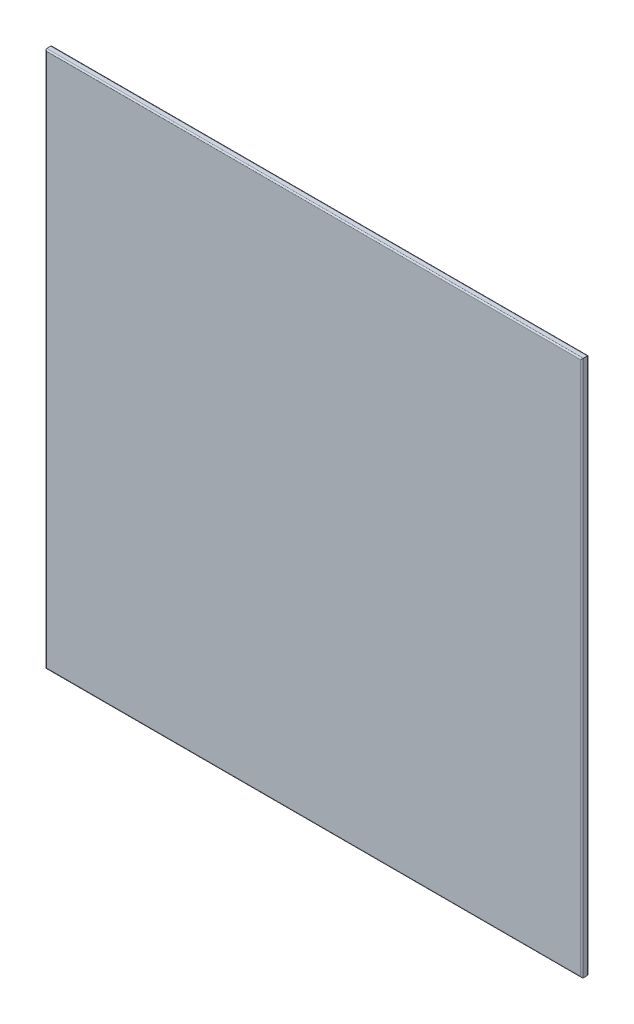
ISO-10303-21;
HEADER;
FILE_DESCRIPTION(('STEP AP214'),'2;1');
FILE_NAME('part.step','',(''),(''),'','','');
FILE_SCHEMA(('AUTOMOTIVE_DESIGN { 1 0 10303 214 1 1 1 1 }'));
ENDSEC;
DATA;
#1=APPLICATION_CONTEXT('core data for automotive mechanical design processes');
#2=APPLICATION_PROTOCOL_DEFINITION('international standard','automotive_design',2000,#1);
#3=PRODUCT_CONTEXT('',#1,'mechanical');
#4=PRODUCT('Part','Part','',(#3));
#5=PRODUCT_RELATED_PRODUCT_CATEGORY('part','',(#4));
#6=PRODUCT_DEFINITION_FORMATION('','',#4);
#7=PRODUCT_DEFINITION_CONTEXT('part definition',#1,'design');
#8=PRODUCT_DEFINITION('design','',#6,#7);
#9=PRODUCT_DEFINITION_SHAPE('','',#8);
#10=(LENGTH_UNIT() NAMED_UNIT(*) SI_UNIT(.MILLI.,.METRE.));
#11=(NAMED_UNIT(*) PLANE_ANGLE_UNIT() SI_UNIT($,.RADIAN.));
#12=(NAMED_UNIT(*) SI_UNIT($,.STERADIAN.) SOLID_ANGLE_UNIT());
#13=UNCERTAINTY_MEASURE_WITH_UNIT(LENGTH_MEASURE(1.E-05),#10,'distance_accuracy_value','');
#14=(GEOMETRIC_REPRESENTATION_CONTEXT(3) GLOBAL_UNCERTAINTY_ASSIGNED_CONTEXT((#13)) GLOBAL_UNIT_ASSIGNED_CONTEXT((#10,
#11,#12)) REPRESENTATION_CONTEXT('',''));
#15=CARTESIAN_POINT('',(0.,0.,0.));
#16=DIRECTION('',(0.,0.,1.));
#17=DIRECTION('',(1.,0.,0.));
#18=AXIS2_PLACEMENT_3D('',#15,#16,#17);
#19=CARTESIAN_POINT('',(-609.999999999993,-610.000000000001,15.));
#20=DIRECTION('',(1.,0.,0.));
#21=DIRECTION('',(0.,0.,-1.));
#22=AXIS2_PLACEMENT_3D('',#19,#20,#21);
#23=PLANE('',#22);
#24=DIRECTION('',(0.,0.,-1.));
#25=VECTOR('',#24,1.);
#26=CARTESIAN_POINT('',(-609.999999999993,609.999999999999,15.));
#27=LINE('',#26,#25);
#28=CARTESIAN_POINT('',(-609.999999999993,609.999999999999,12.));
#29=VERTEX_POINT('',#28);
#30=CARTESIAN_POINT('',(-609.999999999993,609.999999999999,3.));
#31=VERTEX_POINT('',#30);
#32=EDGE_CURVE('E144',#29,#31,#27,.T.);
#33=ORIENTED_EDGE('',*,*,#32,.T.);
#34=DIRECTION('',(0.,-1.,0.));
#35=VECTOR('',#34,1.);
#36=CARTESIAN_POINT('',(-609.999999999993,-610.000000000001,3.));
#37=LINE('',#36,#35);
#38=CARTESIAN_POINT('',(-609.999999999993,-610.000000000001,3.));
#39=VERTEX_POINT('',#38);
#40=EDGE_CURVE('E153',#31,#39,#37,.T.);
#41=ORIENTED_EDGE('',*,*,#40,.T.);
#42=DIRECTION('',(0.,0.,-1.));
#43=VECTOR('',#42,1.);
#44=CARTESIAN_POINT('',(-609.999999999993,-610.000000000001,15.));
#45=LINE('',#44,#43);
#46=CARTESIAN_POINT('',(-609.999999999993,-610.000000000001,12.));
#47=VERTEX_POINT('',#46);
#48=EDGE_CURVE('E122',#47,#39,#45,.T.);
#49=ORIENTED_EDGE('',*,*,#48,.F.);
#50=DIRECTION('',(0.,-1.,0.));
#51=VECTOR('',#50,1.);
#52=CARTESIAN_POINT('',(-609.999999999993,-610.000000000001,12.));
#53=LINE('',#52,#51);
#54=EDGE_CURVE('E155',#47,#29,#53,.F.);
#55=ORIENTED_EDGE('',*,*,#54,.T.);
#56=EDGE_LOOP('',(#33,#41,#49,#55));
#57=FACE_BOUND('',#56,.T.);
#58=ADVANCED_FACE('F35',(#57),#23,.F.);
#59=CARTESIAN_POINT('',(-609.999999999993,-610.000000000001,15.));
#60=DIRECTION('',(0.,1.,0.));
#61=DIRECTION('',(0.,0.,1.));
#62=AXIS2_PLACEMENT_3D('',#59,#60,#61);
#63=PLANE('',#62);
#64=ORIENTED_EDGE('',*,*,#48,.T.);
#65=DIRECTION('',(1.,0.,0.));
#66=VECTOR('',#65,1.);
#67=CARTESIAN_POINT('',(609.999999999996,-610.000000000001,3.));
#68=LINE('',#67,#66);
#69=CARTESIAN_POINT('',(609.999999999996,-610.000000000001,3.));
#70=VERTEX_POINT('',#69);
#71=EDGE_CURVE('E121',#39,#70,#68,.T.);
#72=ORIENTED_EDGE('',*,*,#71,.T.);
#73=DIRECTION('',(0.,0.,-1.));
#74=VECTOR('',#73,1.);
#75=CARTESIAN_POINT('',(609.999999999996,-610.000000000001,15.));
#76=LINE('',#75,#74);
#77=CARTESIAN_POINT('',(609.999999999996,-610.000000000001,12.));
#78=VERTEX_POINT('',#77);
#79=EDGE_CURVE('E104',#78,#70,#76,.T.);
#80=ORIENTED_EDGE('',*,*,#79,.F.);
#81=DIRECTION('',(1.,0.,0.));
#82=VECTOR('',#81,1.);
#83=CARTESIAN_POINT('',(-609.999999999993,-610.000000000001,12.));
#84=LINE('',#83,#82);
#85=EDGE_CURVE('E118',#78,#47,#84,.F.);
#86=ORIENTED_EDGE('',*,*,#85,.T.);
#87=EDGE_LOOP('',(#64,#72,#80,#86));
#88=FACE_BOUND('',#87,.T.);
#89=ADVANCED_FACE('F117',(#88),#63,.F.);
#90=CARTESIAN_POINT('',(609.999999999996,-610.000000000001,15.));
#91=DIRECTION('',(-1.,0.,0.));
#92=DIRECTION('',(0.,0.,1.));
#93=AXIS2_PLACEMENT_3D('',#90,#91,#92);
#94=PLANE('',#93);
#95=ORIENTED_EDGE('',*,*,#79,.T.);
#96=DIRECTION('',(0.,1.,0.));
#97=VECTOR('',#96,1.);
#98=CARTESIAN_POINT('',(609.999999999996,609.999999999999,3.));
#99=LINE('',#98,#97);
#100=CARTESIAN_POINT('',(609.999999999996,609.999999999999,3.));
#101=VERTEX_POINT('',#100);
#102=EDGE_CURVE('E110',#70,#101,#99,.T.);
#103=ORIENTED_EDGE('',*,*,#102,.T.);
#104=DIRECTION('',(0.,0.,-1.));
#105=VECTOR('',#104,1.);
#106=CARTESIAN_POINT('',(609.999999999996,609.999999999999,15.));
#107=LINE('',#106,#105);
#108=CARTESIAN_POINT('',(609.999999999996,609.999999999999,12.));
#109=VERTEX_POINT('',#108);
#110=EDGE_CURVE('E106',#109,#101,#107,.T.);
#111=ORIENTED_EDGE('',*,*,#110,.F.);
#112=DIRECTION('',(0.,1.,0.));
#113=VECTOR('',#112,1.);
#114=CARTESIAN_POINT('',(609.999999999996,-610.000000000001,12.));
#115=LINE('',#114,#113);
#116=EDGE_CURVE('E101',#109,#78,#115,.F.);
#117=ORIENTED_EDGE('',*,*,#116,.T.);
#118=EDGE_LOOP('',(#95,#103,#111,#117));
#119=FACE_BOUND('',#118,.T.);
#120=ADVANCED_FACE('F103',(#119),#94,.F.);
#121=CARTESIAN_POINT('',(-609.999999999993,609.999999999999,15.));
#122=DIRECTION('',(0.,-1.,0.));
#123=DIRECTION('',(0.,0.,-1.));
#124=AXIS2_PLACEMENT_3D('',#121,#122,#123);
#125=PLANE('',#124);
#126=ORIENTED_EDGE('',*,*,#110,.T.);
#127=DIRECTION('',(-1.,0.,0.));
#128=VECTOR('',#127,1.);
#129=CARTESIAN_POINT('',(-609.999999999993,609.999999999999,3.));
#130=LINE('',#129,#128);
#131=EDGE_CURVE('E157',#101,#31,#130,.T.);
#132=ORIENTED_EDGE('',*,*,#131,.T.);
#133=ORIENTED_EDGE('',*,*,#32,.F.);
#134=DIRECTION('',(-1.,0.,0.));
#135=VECTOR('',#134,1.);
#136=CARTESIAN_POINT('',(-609.999999999993,609.999999999999,12.));
#137=LINE('',#136,#135);
#138=EDGE_CURVE('E159',#29,#109,#137,.F.);
#139=ORIENTED_EDGE('',*,*,#138,.T.);
#140=EDGE_LOOP('',(#126,#132,#133,#139));
#141=FACE_BOUND('',#140,.T.);
#142=ADVANCED_FACE('F197',(#141),#125,.F.);
#143=CARTESIAN_POINT('',(0.,0.,15.));
#144=DIRECTION('',(0.,0.,-1.));
#145=DIRECTION('',(-1.,0.,0.));
#146=AXIS2_PLACEMENT_3D('',#143,#144,#145);
#147=PLANE('',#146);
#148=DIRECTION('',(0.,1.,0.));
#149=VECTOR('',#148,1.);
#150=CARTESIAN_POINT('',(606.999999999996,0.,15.));
#151=LINE('',#150,#149);
#152=CARTESIAN_POINT('',(606.999999999996,-607.000000000001,15.));
#153=VERTEX_POINT('',#152);
#154=CARTESIAN_POINT('',(606.999999999996,606.999999999999,15.));
#155=VERTEX_POINT('',#154);
#156=EDGE_CURVE('E44',#153,#155,#151,.T.);
#157=ORIENTED_EDGE('',*,*,#156,.T.);
#158=DIRECTION('',(-1.,0.,0.));
#159=VECTOR('',#158,1.);
#160=CARTESIAN_POINT('',(0.,606.999999999999,15.));
#161=LINE('',#160,#159);
#162=CARTESIAN_POINT('',(-606.999999999993,606.999999999999,15.));
#163=VERTEX_POINT('',#162);
#164=EDGE_CURVE('E11',#155,#163,#161,.T.);
#165=ORIENTED_EDGE('',*,*,#164,.T.);
#166=DIRECTION('',(0.,-1.,0.));
#167=VECTOR('',#166,1.);
#168=CARTESIAN_POINT('',(-606.999999999993,0.,15.));
#169=LINE('',#168,#167);
#170=CARTESIAN_POINT('',(-606.999999999993,-607.000000000001,15.));
#171=VERTEX_POINT('',#170);
#172=EDGE_CURVE('E151',#163,#171,#169,.T.);
#173=ORIENTED_EDGE('',*,*,#172,.T.);
#174=DIRECTION('',(1.,0.,0.));
#175=VECTOR('',#174,1.);
#176=CARTESIAN_POINT('',(0.,-607.000000000001,15.));
#177=LINE('',#176,#175);
#178=EDGE_CURVE('E55',#171,#153,#177,.T.);
#179=ORIENTED_EDGE('',*,*,#178,.T.);
#180=EDGE_LOOP('',(#157,#165,#173,#179));
#181=FACE_BOUND('',#180,.T.);
#182=ADVANCED_FACE('F203',(#181),#147,.F.);
#183=CARTESIAN_POINT('',(0.,0.,0.));
#184=DIRECTION('',(0.,0.,-1.));
#185=DIRECTION('',(-1.,0.,0.));
#186=AXIS2_PLACEMENT_3D('',#183,#184,#185);
#187=PLANE('',#186);
#188=DIRECTION('',(0.,1.,0.));
#189=VECTOR('',#188,1.);
#190=CARTESIAN_POINT('',(606.999999999996,-610.000000000001,0.));
#191=LINE('',#190,#189);
#192=CARTESIAN_POINT('',(606.999999999996,606.999999999999,0.));
#193=VERTEX_POINT('',#192);
#194=CARTESIAN_POINT('',(606.999999999996,-607.000000000001,0.));
#195=VERTEX_POINT('',#194);
#196=EDGE_CURVE('E164',#193,#195,#191,.F.);
#197=ORIENTED_EDGE('',*,*,#196,.T.);
#198=DIRECTION('',(1.,0.,0.));
#199=VECTOR('',#198,1.);
#200=CARTESIAN_POINT('',(-609.999999999993,-607.000000000001,0.));
#201=LINE('',#200,#199);
#202=CARTESIAN_POINT('',(-606.999999999993,-607.000000000001,0.));
#203=VERTEX_POINT('',#202);
#204=EDGE_CURVE('E111',#195,#203,#201,.F.);
#205=ORIENTED_EDGE('',*,*,#204,.T.);
#206=DIRECTION('',(0.,-1.,0.));
#207=VECTOR('',#206,1.);
#208=CARTESIAN_POINT('',(-606.999999999993,609.999999999999,0.));
#209=LINE('',#208,#207);
#210=CARTESIAN_POINT('',(-606.999999999993,606.999999999999,0.));
#211=VERTEX_POINT('',#210);
#212=EDGE_CURVE('E168',#203,#211,#209,.F.);
#213=ORIENTED_EDGE('',*,*,#212,.T.);
#214=DIRECTION('',(-1.,0.,0.));
#215=VECTOR('',#214,1.);
#216=CARTESIAN_POINT('',(609.999999999996,606.999999999999,0.));
#217=LINE('',#216,#215);
#218=EDGE_CURVE('E166',#211,#193,#217,.F.);
#219=ORIENTED_EDGE('',*,*,#218,.T.);
#220=EDGE_LOOP('',(#197,#205,#213,#219));
#221=FACE_BOUND('',#220,.T.);
#222=ADVANCED_FACE('F205',(#221),#187,.T.);
#223=CARTESIAN_POINT('',(-609.999999999993,606.999999999999,3.));
#224=DIRECTION('',(1.,0.,0.));
#225=DIRECTION('',(0.,0.,-1.));
#226=AXIS2_PLACEMENT_3D('',#223,#224,#225);
#227=CYLINDRICAL_SURFACE('',#226,3.);
#228=CARTESIAN_POINT('',(606.999999999996,606.999999999999,3.));
#229=DIRECTION('',(0.707106781186547,-0.707106781186547,0.));
#230=DIRECTION('',(0.707106781186547,0.707106781186547,0.));
#231=AXIS2_PLACEMENT_3D('',#228,#229,#230);
#232=ELLIPSE('',#231,4.24264068711928,3.);
#233=EDGE_CURVE('E145',#193,#101,#232,.T.);
#234=ORIENTED_EDGE('',*,*,#233,.F.);
#235=ORIENTED_EDGE('',*,*,#218,.F.);
#236=CARTESIAN_POINT('',(-606.999999999993,606.999999999999,3.));
#237=DIRECTION('',(0.707106781186547,0.707106781186547,0.));
#238=DIRECTION('',(-0.707106781186547,0.707106781186547,0.));
#239=AXIS2_PLACEMENT_3D('',#236,#237,#238);
#240=ELLIPSE('',#239,4.24264068711928,3.);
#241=EDGE_CURVE('E141',#31,#211,#240,.F.);
#242=ORIENTED_EDGE('',*,*,#241,.F.);
#243=ORIENTED_EDGE('',*,*,#131,.F.);
#244=EDGE_LOOP('',(#234,#235,#242,#243));
#245=FACE_BOUND('',#244,.T.);
#246=ADVANCED_FACE('F184',(#245),#227,.T.);
#247=CARTESIAN_POINT('',(-606.999999999993,-610.000000000001,3.));
#248=DIRECTION('',(0.,1.,0.));
#249=DIRECTION('',(0.,0.,1.));
#250=AXIS2_PLACEMENT_3D('',#247,#248,#249);
#251=CYLINDRICAL_SURFACE('',#250,3.);
#252=ORIENTED_EDGE('',*,*,#241,.T.);
#253=ORIENTED_EDGE('',*,*,#212,.F.);
#254=CARTESIAN_POINT('',(-606.999999999993,-607.000000000001,3.));
#255=DIRECTION('',(-0.707106781186547,0.707106781186547,0.));
#256=DIRECTION('',(0.707106781186547,0.707106781186547,0.));
#257=AXIS2_PLACEMENT_3D('',#254,#255,#256);
#258=ELLIPSE('',#257,4.24264068711928,3.);
#259=EDGE_CURVE('E132',#39,#203,#258,.F.);
#260=ORIENTED_EDGE('',*,*,#259,.F.);
#261=ORIENTED_EDGE('',*,*,#40,.F.);
#262=EDGE_LOOP('',(#252,#253,#260,#261));
#263=FACE_BOUND('',#262,.T.);
#264=ADVANCED_FACE('F188',(#263),#251,.T.);
#265=CARTESIAN_POINT('',(606.999999999996,-610.000000000001,3.));
#266=DIRECTION('',(0.,-1.,0.));
#267=DIRECTION('',(0.,0.,-1.));
#268=AXIS2_PLACEMENT_3D('',#265,#266,#267);
#269=CYLINDRICAL_SURFACE('',#268,3.);
#270=ORIENTED_EDGE('',*,*,#233,.T.);
#271=ORIENTED_EDGE('',*,*,#102,.F.);
#272=CARTESIAN_POINT('',(606.999999999996,-607.000000000001,3.));
#273=DIRECTION('',(-0.707106781186547,-0.707106781186547,0.));
#274=DIRECTION('',(0.707106781186547,-0.707106781186547,0.));
#275=AXIS2_PLACEMENT_3D('',#272,#273,#274);
#276=ELLIPSE('',#275,4.24264068711928,3.);
#277=EDGE_CURVE('E131',#195,#70,#276,.T.);
#278=ORIENTED_EDGE('',*,*,#277,.F.);
#279=ORIENTED_EDGE('',*,*,#196,.F.);
#280=EDGE_LOOP('',(#270,#271,#278,#279));
#281=FACE_BOUND('',#280,.T.);
#282=ADVANCED_FACE('F196',(#281),#269,.T.);
#283=CARTESIAN_POINT('',(-609.999999999993,-607.000000000001,3.));
#284=DIRECTION('',(-1.,0.,0.));
#285=DIRECTION('',(0.,0.,1.));
#286=AXIS2_PLACEMENT_3D('',#283,#284,#285);
#287=CYLINDRICAL_SURFACE('',#286,3.);
#288=ORIENTED_EDGE('',*,*,#259,.T.);
#289=ORIENTED_EDGE('',*,*,#204,.F.);
#290=ORIENTED_EDGE('',*,*,#277,.T.);
#291=ORIENTED_EDGE('',*,*,#71,.F.);
#292=EDGE_LOOP('',(#288,#289,#290,#291));
#293=FACE_BOUND('',#292,.T.);
#294=ADVANCED_FACE('F191',(#293),#287,.T.);
#295=CARTESIAN_POINT('',(0.,-607.000000000001,12.));
#296=DIRECTION('',(1.,0.,0.));
#297=DIRECTION('',(0.,0.,-1.));
#298=AXIS2_PLACEMENT_3D('',#295,#296,#297);
#299=CYLINDRICAL_SURFACE('',#298,3.);
#300=CARTESIAN_POINT('',(-606.999999999993,-607.000000000001,12.));
#301=DIRECTION('',(0.707106781186547,-0.707106781186547,0.));
#302=DIRECTION('',(-0.707106781186547,-0.707106781186547,0.));
#303=AXIS2_PLACEMENT_3D('',#300,#301,#302);
#304=ELLIPSE('',#303,4.24264068711928,3.);
#305=EDGE_CURVE('E127',#47,#171,#304,.F.);
#306=ORIENTED_EDGE('',*,*,#305,.F.);
#307=ORIENTED_EDGE('',*,*,#85,.F.);
#308=CARTESIAN_POINT('',(606.999999999996,-607.000000000001,12.));
#309=DIRECTION('',(0.707106781186547,0.707106781186547,0.));
#310=DIRECTION('',(0.707106781186547,-0.707106781186547,0.));
#311=AXIS2_PLACEMENT_3D('',#308,#309,#310);
#312=ELLIPSE('',#311,4.24264068711928,3.);
#313=EDGE_CURVE('E39',#153,#78,#312,.T.);
#314=ORIENTED_EDGE('',*,*,#313,.F.);
#315=ORIENTED_EDGE('',*,*,#178,.F.);
#316=EDGE_LOOP('',(#306,#307,#314,#315));
#317=FACE_BOUND('',#316,.T.);
#318=ADVANCED_FACE('F37',(#317),#299,.T.);
#319=CARTESIAN_POINT('',(606.999999999996,0.,12.));
#320=DIRECTION('',(0.,1.,0.));
#321=DIRECTION('',(0.,0.,1.));
#322=AXIS2_PLACEMENT_3D('',#319,#320,#321);
#323=CYLINDRICAL_SURFACE('',#322,3.);
#324=ORIENTED_EDGE('',*,*,#313,.T.);
#325=ORIENTED_EDGE('',*,*,#116,.F.);
#326=CARTESIAN_POINT('',(606.999999999996,606.999999999999,12.));
#327=DIRECTION('',(-0.707106781186547,0.707106781186547,0.));
#328=DIRECTION('',(0.707106781186547,0.707106781186547,0.));
#329=AXIS2_PLACEMENT_3D('',#326,#327,#328);
#330=ELLIPSE('',#329,4.24264068711928,3.);
#331=EDGE_CURVE('E134',#155,#109,#330,.T.);
#332=ORIENTED_EDGE('',*,*,#331,.F.);
#333=ORIENTED_EDGE('',*,*,#156,.F.);
#334=EDGE_LOOP('',(#324,#325,#332,#333));
#335=FACE_BOUND('',#334,.T.);
#336=ADVANCED_FACE('F130',(#335),#323,.T.);
#337=CARTESIAN_POINT('',(-606.999999999993,0.,12.));
#338=DIRECTION('',(0.,-1.,0.));
#339=DIRECTION('',(0.,0.,-1.));
#340=AXIS2_PLACEMENT_3D('',#337,#338,#339);
#341=CYLINDRICAL_SURFACE('',#340,3.);
#342=ORIENTED_EDGE('',*,*,#305,.T.);
#343=ORIENTED_EDGE('',*,*,#172,.F.);
#344=CARTESIAN_POINT('',(-606.999999999993,606.999999999999,12.));
#345=DIRECTION('',(-0.707106781186547,-0.707106781186547,0.));
#346=DIRECTION('',(0.707106781186547,-0.707106781186547,0.));
#347=AXIS2_PLACEMENT_3D('',#344,#345,#346);
#348=ELLIPSE('',#347,4.24264068711928,3.);
#349=EDGE_CURVE('E137',#29,#163,#348,.F.);
#350=ORIENTED_EDGE('',*,*,#349,.F.);
#351=ORIENTED_EDGE('',*,*,#54,.F.);
#352=EDGE_LOOP('',(#342,#343,#350,#351));
#353=FACE_BOUND('',#352,.T.);
#354=ADVANCED_FACE('F202',(#353),#341,.T.);
#355=CARTESIAN_POINT('',(0.,606.999999999999,12.));
#356=DIRECTION('',(-1.,0.,0.));
#357=DIRECTION('',(0.,0.,1.));
#358=AXIS2_PLACEMENT_3D('',#355,#356,#357);
#359=CYLINDRICAL_SURFACE('',#358,3.);
#360=ORIENTED_EDGE('',*,*,#331,.T.);
#361=ORIENTED_EDGE('',*,*,#138,.F.);
#362=ORIENTED_EDGE('',*,*,#349,.T.);
#363=ORIENTED_EDGE('',*,*,#164,.F.);
#364=EDGE_LOOP('',(#360,#361,#362,#363));
#365=FACE_BOUND('',#364,.T.);
#366=ADVANCED_FACE('F200',(#365),#359,.T.);
#367=CLOSED_SHELL('',(#58,#89,#120,#142,#182,#222,#246,#264,#282,#294,#318,#336,#354,#366));
#368=MANIFOLD_SOLID_BREP('B2',#367);
#369=ADVANCED_BREP_SHAPE_REPRESENTATION('',(#18,#368),#14);
#370=SHAPE_DEFINITION_REPRESENTATION(#9,#369);
ENDSEC;
END-ISO-10303-21;
